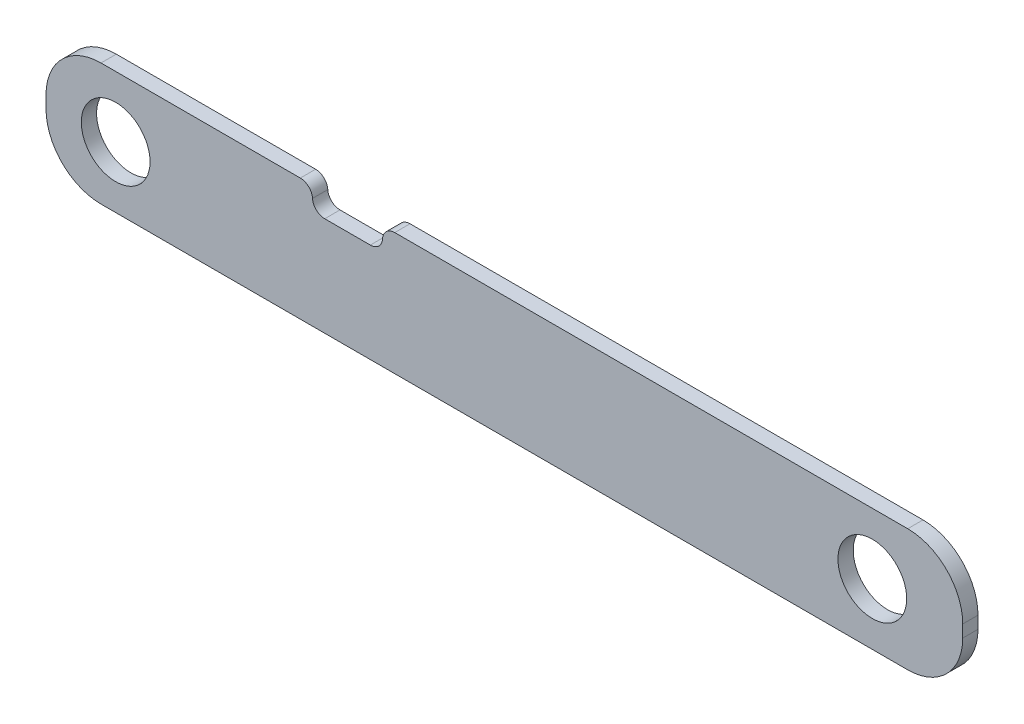
ISO-10303-21;
HEADER;
FILE_DESCRIPTION(('STEP AP214'),'2;1');
FILE_NAME('part.step','',(''),(''),'','','');
FILE_SCHEMA(('AUTOMOTIVE_DESIGN { 1 0 10303 214 1 1 1 1 }'));
ENDSEC;
DATA;
#1=APPLICATION_CONTEXT('core data for automotive mechanical design processes');
#2=APPLICATION_PROTOCOL_DEFINITION('international standard','automotive_design',2000,#1);
#3=PRODUCT_CONTEXT('',#1,'mechanical');
#4=PRODUCT('Part','Part','',(#3));
#5=PRODUCT_RELATED_PRODUCT_CATEGORY('part','',(#4));
#6=PRODUCT_DEFINITION_FORMATION('','',#4);
#7=PRODUCT_DEFINITION_CONTEXT('part definition',#1,'design');
#8=PRODUCT_DEFINITION('design','',#6,#7);
#9=PRODUCT_DEFINITION_SHAPE('','',#8);
#10=(LENGTH_UNIT() NAMED_UNIT(*) SI_UNIT(.MILLI.,.METRE.));
#11=(NAMED_UNIT(*) PLANE_ANGLE_UNIT() SI_UNIT($,.RADIAN.));
#12=(NAMED_UNIT(*) SI_UNIT($,.STERADIAN.) SOLID_ANGLE_UNIT());
#13=UNCERTAINTY_MEASURE_WITH_UNIT(LENGTH_MEASURE(1.E-05),#10,'distance_accuracy_value','');
#14=(GEOMETRIC_REPRESENTATION_CONTEXT(3) GLOBAL_UNCERTAINTY_ASSIGNED_CONTEXT((#13)) GLOBAL_UNIT_ASSIGNED_CONTEXT((#10,
#11,#12)) REPRESENTATION_CONTEXT('',''));
#15=CARTESIAN_POINT('',(0.,0.,0.));
#16=DIRECTION('',(0.,0.,1.));
#17=DIRECTION('',(1.,0.,0.));
#18=AXIS2_PLACEMENT_3D('',#15,#16,#17);
#19=CARTESIAN_POINT('',(-237.22641509434,105.433962264151,6.35));
#20=DIRECTION('',(0.,-1.,0.));
#21=DIRECTION('',(0.,0.,-1.));
#22=AXIS2_PLACEMENT_3D('',#19,#20,#21);
#23=PLANE('',#22);
#24=DIRECTION('',(-1.,0.,0.));
#25=VECTOR('',#24,1.);
#26=CARTESIAN_POINT('',(-237.22641509434,105.433962264151,0.));
#27=LINE('',#26,#25);
#28=CARTESIAN_POINT('',(120.91358490566,105.433962264151,0.));
#29=VERTEX_POINT('',#28);
#30=CARTESIAN_POINT('',(-92.2791363600619,105.433962264151,0.));
#31=VERTEX_POINT('',#30);
#32=EDGE_CURVE('E158',#29,#31,#27,.T.);
#33=ORIENTED_EDGE('',*,*,#32,.T.);
#34=DIRECTION('',(0.,0.,1.));
#35=VECTOR('',#34,1.);
#36=CARTESIAN_POINT('',(-92.2791363600619,105.433962264151,6.35));
#37=LINE('',#36,#35);
#38=CARTESIAN_POINT('',(-92.2791363600619,105.433962264151,6.35));
#39=VERTEX_POINT('',#38);
#40=EDGE_CURVE('E239',#31,#39,#37,.T.);
#41=ORIENTED_EDGE('',*,*,#40,.T.);
#42=DIRECTION('',(-1.,0.,0.));
#43=VECTOR('',#42,1.);
#44=CARTESIAN_POINT('',(-237.22641509434,105.433962264151,6.35));
#45=LINE('',#44,#43);
#46=CARTESIAN_POINT('',(120.91358490566,105.433962264151,6.35));
#47=VERTEX_POINT('',#46);
#48=EDGE_CURVE('E161',#47,#39,#45,.T.);
#49=ORIENTED_EDGE('',*,*,#48,.F.);
#50=DIRECTION('',(0.,0.,-1.));
#51=VECTOR('',#50,1.);
#52=CARTESIAN_POINT('',(120.91358490566,105.433962264151,6.35));
#53=LINE('',#52,#51);
#54=EDGE_CURVE('E146',#47,#29,#53,.T.);
#55=ORIENTED_EDGE('',*,*,#54,.T.);
#56=EDGE_LOOP('',(#33,#41,#49,#55));
#57=FACE_BOUND('',#56,.T.);
#58=ADVANCED_FACE('F39',(#57),#23,.F.);
#59=CARTESIAN_POINT('',(-237.22641509434,105.433962264151,6.35));
#60=DIRECTION('',(1.,0.,0.));
#61=DIRECTION('',(0.,1.,0.));
#62=AXIS2_PLACEMENT_3D('',#59,#60,#61);
#63=PLANE('',#62);
#64=DIRECTION('',(0.,-1.,0.));
#65=VECTOR('',#64,1.);
#66=CARTESIAN_POINT('',(-237.22641509434,105.433962264151,6.35));
#67=LINE('',#66,#65);
#68=CARTESIAN_POINT('',(-237.22641509434,82.5739622641509,6.35));
#69=VERTEX_POINT('',#68);
#70=CARTESIAN_POINT('',(-237.22641509434,77.4939622641509,6.35));
#71=VERTEX_POINT('',#70);
#72=EDGE_CURVE('E168',#69,#71,#67,.T.);
#73=ORIENTED_EDGE('',*,*,#72,.F.);
#74=DIRECTION('',(0.,0.,-1.));
#75=VECTOR('',#74,1.);
#76=CARTESIAN_POINT('',(-237.22641509434,82.5739622641509,6.35));
#77=LINE('',#76,#75);
#78=CARTESIAN_POINT('',(-237.22641509434,82.5739622641509,0.));
#79=VERTEX_POINT('',#78);
#80=EDGE_CURVE('E214',#69,#79,#77,.T.);
#81=ORIENTED_EDGE('',*,*,#80,.T.);
#82=DIRECTION('',(0.,-1.,0.));
#83=VECTOR('',#82,1.);
#84=CARTESIAN_POINT('',(-237.22641509434,105.433962264151,0.));
#85=LINE('',#84,#83);
#86=CARTESIAN_POINT('',(-237.22641509434,77.4939622641509,0.));
#87=VERTEX_POINT('',#86);
#88=EDGE_CURVE('E278',#79,#87,#85,.T.);
#89=ORIENTED_EDGE('',*,*,#88,.T.);
#90=DIRECTION('',(0.,0.,-1.));
#91=VECTOR('',#90,1.);
#92=CARTESIAN_POINT('',(-237.22641509434,77.4939622641509,6.35));
#93=LINE('',#92,#91);
#94=EDGE_CURVE('E207',#87,#71,#93,.F.);
#95=ORIENTED_EDGE('',*,*,#94,.T.);
#96=EDGE_LOOP('',(#73,#81,#89,#95));
#97=FACE_BOUND('',#96,.T.);
#98=ADVANCED_FACE('F305',(#97),#63,.F.);
#99=CARTESIAN_POINT('',(-237.22641509434,54.6339622641509,6.35));
#100=DIRECTION('',(0.,1.,0.));
#101=DIRECTION('',(-1.,0.,0.));
#102=AXIS2_PLACEMENT_3D('',#99,#100,#101);
#103=PLANE('',#102);
#104=DIRECTION('',(1.,0.,0.));
#105=VECTOR('',#104,1.);
#106=CARTESIAN_POINT('',(-237.22641509434,54.6339622641509,6.35));
#107=LINE('',#106,#105);
#108=CARTESIAN_POINT('',(-214.36641509434,54.6339622641509,6.35));
#109=VERTEX_POINT('',#108);
#110=CARTESIAN_POINT('',(120.91358490566,54.633962264151,6.35));
#111=VERTEX_POINT('',#110);
#112=EDGE_CURVE('E173',#109,#111,#107,.T.);
#113=ORIENTED_EDGE('',*,*,#112,.F.);
#114=DIRECTION('',(0.,0.,-1.));
#115=VECTOR('',#114,1.);
#116=CARTESIAN_POINT('',(-214.36641509434,54.6339622641509,6.35));
#117=LINE('',#116,#115);
#118=CARTESIAN_POINT('',(-214.36641509434,54.6339622641509,0.));
#119=VERTEX_POINT('',#118);
#120=EDGE_CURVE('E199',#109,#119,#117,.T.);
#121=ORIENTED_EDGE('',*,*,#120,.T.);
#122=DIRECTION('',(1.,0.,0.));
#123=VECTOR('',#122,1.);
#124=CARTESIAN_POINT('',(-237.22641509434,54.6339622641509,0.));
#125=LINE('',#124,#123);
#126=CARTESIAN_POINT('',(120.91358490566,54.633962264151,0.));
#127=VERTEX_POINT('',#126);
#128=EDGE_CURVE('E280',#119,#127,#125,.T.);
#129=ORIENTED_EDGE('',*,*,#128,.T.);
#130=DIRECTION('',(0.,0.,-1.));
#131=VECTOR('',#130,1.);
#132=CARTESIAN_POINT('',(120.91358490566,54.633962264151,6.35));
#133=LINE('',#132,#131);
#134=EDGE_CURVE('E192',#127,#111,#133,.F.);
#135=ORIENTED_EDGE('',*,*,#134,.T.);
#136=EDGE_LOOP('',(#113,#121,#129,#135));
#137=FACE_BOUND('',#136,.T.);
#138=ADVANCED_FACE('F294',(#137),#103,.F.);
#139=CARTESIAN_POINT('',(143.77358490566,105.433962264151,6.35));
#140=DIRECTION('',(-1.,0.,0.));
#141=DIRECTION('',(0.,-1.,0.));
#142=AXIS2_PLACEMENT_3D('',#139,#140,#141);
#143=PLANE('',#142);
#144=DIRECTION('',(0.,1.,0.));
#145=VECTOR('',#144,1.);
#146=CARTESIAN_POINT('',(143.77358490566,105.433962264151,6.35));
#147=LINE('',#146,#145);
#148=CARTESIAN_POINT('',(143.77358490566,77.493962264151,6.35));
#149=VERTEX_POINT('',#148);
#150=CARTESIAN_POINT('',(143.77358490566,82.5739622641509,6.35));
#151=VERTEX_POINT('',#150);
#152=EDGE_CURVE('E271',#149,#151,#147,.T.);
#153=ORIENTED_EDGE('',*,*,#152,.F.);
#154=DIRECTION('',(0.,0.,-1.));
#155=VECTOR('',#154,1.);
#156=CARTESIAN_POINT('',(143.77358490566,77.493962264151,6.35));
#157=LINE('',#156,#155);
#158=CARTESIAN_POINT('',(143.77358490566,77.493962264151,0.));
#159=VERTEX_POINT('',#158);
#160=EDGE_CURVE('E184',#149,#159,#157,.T.);
#161=ORIENTED_EDGE('',*,*,#160,.T.);
#162=DIRECTION('',(0.,1.,0.));
#163=VECTOR('',#162,1.);
#164=CARTESIAN_POINT('',(143.77358490566,105.433962264151,0.));
#165=LINE('',#164,#163);
#166=CARTESIAN_POINT('',(143.77358490566,82.5739622641509,0.));
#167=VERTEX_POINT('',#166);
#168=EDGE_CURVE('E175',#159,#167,#165,.T.);
#169=ORIENTED_EDGE('',*,*,#168,.T.);
#170=DIRECTION('',(0.,0.,-1.));
#171=VECTOR('',#170,1.);
#172=CARTESIAN_POINT('',(143.77358490566,82.5739622641509,6.35));
#173=LINE('',#172,#171);
#174=EDGE_CURVE('E148',#167,#151,#173,.F.);
#175=ORIENTED_EDGE('',*,*,#174,.T.);
#176=EDGE_LOOP('',(#153,#161,#169,#175));
#177=FACE_BOUND('',#176,.T.);
#178=ADVANCED_FACE('F288',(#177),#143,.F.);
#179=CARTESIAN_POINT('',(-131.523813882823,105.433962264151,6.35));
#180=VERTEX_POINT('',#179);
#181=CARTESIAN_POINT('',(-214.36641509434,105.433962264151,6.35));
#182=VERTEX_POINT('',#181);
#183=EDGE_CURVE('E268',#180,#182,#45,.T.);
#184=ORIENTED_EDGE('',*,*,#183,.F.);
#185=DIRECTION('',(0.,0.,1.));
#186=VECTOR('',#185,1.);
#187=CARTESIAN_POINT('',(-131.523813882823,105.433962264151,6.35));
#188=LINE('',#187,#186);
#189=CARTESIAN_POINT('',(-131.523813882823,105.433962264151,0.));
#190=VERTEX_POINT('',#189);
#191=EDGE_CURVE('E232',#180,#190,#188,.F.);
#192=ORIENTED_EDGE('',*,*,#191,.T.);
#193=CARTESIAN_POINT('',(-214.36641509434,105.433962264151,0.));
#194=VERTEX_POINT('',#193);
#195=EDGE_CURVE('E169',#190,#194,#27,.T.);
#196=ORIENTED_EDGE('',*,*,#195,.T.);
#197=DIRECTION('',(0.,0.,-1.));
#198=VECTOR('',#197,1.);
#199=CARTESIAN_POINT('',(-214.36641509434,105.433962264151,6.35));
#200=LINE('',#199,#198);
#201=EDGE_CURVE('E222',#194,#182,#200,.F.);
#202=ORIENTED_EDGE('',*,*,#201,.T.);
#203=EDGE_LOOP('',(#184,#192,#196,#202));
#204=FACE_BOUND('',#203,.T.);
#205=ADVANCED_FACE('F312',(#204),#23,.F.);
#206=CARTESIAN_POINT('',(0.,0.,6.35));
#207=DIRECTION('',(0.,0.,1.));
#208=DIRECTION('',(1.,0.,0.));
#209=AXIS2_PLACEMENT_3D('',#206,#207,#208);
#210=PLANE('',#209);
#211=CARTESIAN_POINT('',(106.195061697882,80.033962264151,6.35));
#212=DIRECTION('',(0.,0.,1.));
#213=DIRECTION('',(1.,0.,0.));
#214=AXIS2_PLACEMENT_3D('',#211,#212,#213);
#215=CIRCLE('',#214,14.2875);
#216=CARTESIAN_POINT('',(120.482561697882,80.033962264151,6.35));
#217=VERTEX_POINT('',#216);
#218=EDGE_CURVE('E327',#217,#217,#215,.T.);
#219=ORIENTED_EDGE('',*,*,#218,.F.);
#220=EDGE_LOOP('',(#219));
#221=FACE_BOUND('',#220,.T.);
#222=ORIENTED_EDGE('',*,*,#48,.T.);
#223=CARTESIAN_POINT('',(-92.2791363600619,100.353962264151,6.35));
#224=DIRECTION('',(0.,0.,1.));
#225=DIRECTION('',(1.,0.,0.));
#226=AXIS2_PLACEMENT_3D('',#223,#224,#225);
#227=CIRCLE('',#226,5.07999999999999);
#228=CARTESIAN_POINT('',(-97.3507309280969,100.646072752627,6.35));
#229=VERTEX_POINT('',#228);
#230=EDGE_CURVE('E242',#39,#229,#227,.T.);
#231=ORIENTED_EDGE('',*,*,#230,.T.);
#232=CARTESIAN_POINT('',(-102.422325496132,100.938183241103,6.35));
#233=DIRECTION('',(0.,0.,1.));
#234=DIRECTION('',(1.,0.,0.));
#235=AXIS2_PLACEMENT_3D('',#232,#233,#234);
#236=CIRCLE('',#235,5.07999999999999);
#237=CARTESIAN_POINT('',(-102.422325496132,95.8581832411029,6.35));
#238=VERTEX_POINT('',#237);
#239=EDGE_CURVE('E48',#229,#238,#236,.F.);
#240=ORIENTED_EDGE('',*,*,#239,.T.);
#241=DIRECTION('',(1.,0.,0.));
#242=VECTOR('',#241,1.);
#243=CARTESIAN_POINT('',(-126.443813882823,95.8581832411029,6.35));
#244=LINE('',#243,#242);
#245=CARTESIAN_POINT('',(-121.380624746753,95.8581832411029,6.35));
#246=VERTEX_POINT('',#245);
#247=EDGE_CURVE('E328',#246,#238,#244,.T.);
#248=ORIENTED_EDGE('',*,*,#247,.F.);
#249=CARTESIAN_POINT('',(-121.380624746753,100.938183241103,6.35));
#250=DIRECTION('',(0.,0.,1.));
#251=DIRECTION('',(1.,0.,0.));
#252=AXIS2_PLACEMENT_3D('',#249,#250,#251);
#253=CIRCLE('',#252,5.07999999999999);
#254=CARTESIAN_POINT('',(-126.452219314788,100.646072752627,6.35));
#255=VERTEX_POINT('',#254);
#256=EDGE_CURVE('E254',#246,#255,#253,.F.);
#257=ORIENTED_EDGE('',*,*,#256,.T.);
#258=CARTESIAN_POINT('',(-131.523813882823,100.353962264151,6.35));
#259=DIRECTION('',(0.,0.,1.));
#260=DIRECTION('',(1.,0.,0.));
#261=AXIS2_PLACEMENT_3D('',#258,#259,#260);
#262=CIRCLE('',#261,5.07999999999999);
#263=EDGE_CURVE('E229',#255,#180,#262,.T.);
#264=ORIENTED_EDGE('',*,*,#263,.T.);
#265=ORIENTED_EDGE('',*,*,#183,.T.);
#266=CARTESIAN_POINT('',(-214.36641509434,82.5739622641509,6.35));
#267=DIRECTION('',(0.,0.,1.));
#268=DIRECTION('',(1.,0.,0.));
#269=AXIS2_PLACEMENT_3D('',#266,#267,#268);
#270=CIRCLE('',#269,22.86);
#271=EDGE_CURVE('E226',#182,#69,#270,.T.);
#272=ORIENTED_EDGE('',*,*,#271,.T.);
#273=ORIENTED_EDGE('',*,*,#72,.T.);
#274=CARTESIAN_POINT('',(-214.36641509434,77.493962264151,6.35));
#275=DIRECTION('',(0.,0.,1.));
#276=DIRECTION('',(1.,0.,0.));
#277=AXIS2_PLACEMENT_3D('',#274,#275,#276);
#278=CIRCLE('',#277,22.86);
#279=EDGE_CURVE('E211',#71,#109,#278,.T.);
#280=ORIENTED_EDGE('',*,*,#279,.T.);
#281=ORIENTED_EDGE('',*,*,#112,.T.);
#282=CARTESIAN_POINT('',(120.91358490566,77.493962264151,6.35));
#283=DIRECTION('',(0.,0.,1.));
#284=DIRECTION('',(1.,0.,0.));
#285=AXIS2_PLACEMENT_3D('',#282,#283,#284);
#286=CIRCLE('',#285,22.86);
#287=EDGE_CURVE('E196',#111,#149,#286,.T.);
#288=ORIENTED_EDGE('',*,*,#287,.T.);
#289=ORIENTED_EDGE('',*,*,#152,.T.);
#290=CARTESIAN_POINT('',(120.91358490566,82.5739622641509,6.35));
#291=DIRECTION('',(0.,0.,1.));
#292=DIRECTION('',(1.,0.,0.));
#293=AXIS2_PLACEMENT_3D('',#290,#291,#292);
#294=CIRCLE('',#293,22.86);
#295=EDGE_CURVE('E181',#151,#47,#294,.T.);
#296=ORIENTED_EDGE('',*,*,#295,.T.);
#297=EDGE_LOOP('',(#222,#231,#240,#248,#257,#264,#265,#272,#273,#280,#281,#288,#289,#296));
#298=FACE_BOUND('',#297,.T.);
#299=CARTESIAN_POINT('',(-208.270713759816,80.033962264151,6.35));
#300=DIRECTION('',(0.,0.,1.));
#301=DIRECTION('',(1.,0.,0.));
#302=AXIS2_PLACEMENT_3D('',#299,#300,#301);
#303=CIRCLE('',#302,14.2875);
#304=CARTESIAN_POINT('',(-193.983213759816,80.033962264151,6.35));
#305=VERTEX_POINT('',#304);
#306=EDGE_CURVE('E340',#305,#305,#303,.T.);
#307=ORIENTED_EDGE('',*,*,#306,.F.);
#308=EDGE_LOOP('',(#307));
#309=FACE_BOUND('',#308,.T.);
#310=ADVANCED_FACE('F347',(#221,#298,#309),#210,.T.);
#311=CARTESIAN_POINT('',(0.,0.,0.));
#312=DIRECTION('',(0.,0.,1.));
#313=DIRECTION('',(1.,0.,0.));
#314=AXIS2_PLACEMENT_3D('',#311,#312,#313);
#315=PLANE('',#314);
#316=CARTESIAN_POINT('',(106.195061697882,80.033962264151,0.));
#317=DIRECTION('',(0.,0.,1.));
#318=DIRECTION('',(1.,0.,0.));
#319=AXIS2_PLACEMENT_3D('',#316,#317,#318);
#320=CIRCLE('',#319,14.2875);
#321=CARTESIAN_POINT('',(120.482561697882,80.033962264151,0.));
#322=VERTEX_POINT('',#321);
#323=EDGE_CURVE('E281',#322,#322,#320,.T.);
#324=ORIENTED_EDGE('',*,*,#323,.T.);
#325=EDGE_LOOP('',(#324));
#326=FACE_BOUND('',#325,.T.);
#327=CARTESIAN_POINT('',(-208.270713759816,80.033962264151,0.));
#328=DIRECTION('',(0.,0.,1.));
#329=DIRECTION('',(1.,0.,0.));
#330=AXIS2_PLACEMENT_3D('',#327,#328,#329);
#331=CIRCLE('',#330,14.2875);
#332=CARTESIAN_POINT('',(-193.983213759816,80.033962264151,0.));
#333=VERTEX_POINT('',#332);
#334=EDGE_CURVE('E334',#333,#333,#331,.T.);
#335=ORIENTED_EDGE('',*,*,#334,.T.);
#336=EDGE_LOOP('',(#335));
#337=FACE_BOUND('',#336,.T.);
#338=DIRECTION('',(1.,0.,0.));
#339=VECTOR('',#338,1.);
#340=CARTESIAN_POINT('',(-126.443813882823,95.8581832411029,0.));
#341=LINE('',#340,#339);
#342=CARTESIAN_POINT('',(-121.380624746753,95.8581832411029,0.));
#343=VERTEX_POINT('',#342);
#344=CARTESIAN_POINT('',(-102.422325496132,95.8581832411029,0.));
#345=VERTEX_POINT('',#344);
#346=EDGE_CURVE('E323',#343,#345,#341,.T.);
#347=ORIENTED_EDGE('',*,*,#346,.T.);
#348=CARTESIAN_POINT('',(-102.422325496132,100.938183241103,0.));
#349=DIRECTION('',(0.,0.,1.));
#350=DIRECTION('',(1.,0.,0.));
#351=AXIS2_PLACEMENT_3D('',#348,#349,#350);
#352=CIRCLE('',#351,5.07999999999999);
#353=CARTESIAN_POINT('',(-97.3507309280969,100.646072752627,0.));
#354=VERTEX_POINT('',#353);
#355=EDGE_CURVE('E11',#345,#354,#352,.T.);
#356=ORIENTED_EDGE('',*,*,#355,.T.);
#357=CARTESIAN_POINT('',(-92.2791363600619,100.353962264151,0.));
#358=DIRECTION('',(0.,0.,1.));
#359=DIRECTION('',(1.,0.,0.));
#360=AXIS2_PLACEMENT_3D('',#357,#358,#359);
#361=CIRCLE('',#360,5.07999999999999);
#362=EDGE_CURVE('E166',#354,#31,#361,.F.);
#363=ORIENTED_EDGE('',*,*,#362,.T.);
#364=ORIENTED_EDGE('',*,*,#32,.F.);
#365=CARTESIAN_POINT('',(120.91358490566,82.5739622641509,0.));
#366=DIRECTION('',(0.,0.,1.));
#367=DIRECTION('',(1.,0.,0.));
#368=AXIS2_PLACEMENT_3D('',#365,#366,#367);
#369=CIRCLE('',#368,22.86);
#370=EDGE_CURVE('E142',#29,#167,#369,.F.);
#371=ORIENTED_EDGE('',*,*,#370,.T.);
#372=ORIENTED_EDGE('',*,*,#168,.F.);
#373=CARTESIAN_POINT('',(120.91358490566,77.493962264151,0.));
#374=DIRECTION('',(0.,0.,1.));
#375=DIRECTION('',(1.,0.,0.));
#376=AXIS2_PLACEMENT_3D('',#373,#374,#375);
#377=CIRCLE('',#376,22.86);
#378=EDGE_CURVE('E188',#159,#127,#377,.F.);
#379=ORIENTED_EDGE('',*,*,#378,.T.);
#380=ORIENTED_EDGE('',*,*,#128,.F.);
#381=CARTESIAN_POINT('',(-214.36641509434,77.493962264151,0.));
#382=DIRECTION('',(0.,0.,1.));
#383=DIRECTION('',(1.,0.,0.));
#384=AXIS2_PLACEMENT_3D('',#381,#382,#383);
#385=CIRCLE('',#384,22.86);
#386=EDGE_CURVE('E203',#119,#87,#385,.F.);
#387=ORIENTED_EDGE('',*,*,#386,.T.);
#388=ORIENTED_EDGE('',*,*,#88,.F.);
#389=CARTESIAN_POINT('',(-214.36641509434,82.5739622641509,0.));
#390=DIRECTION('',(0.,0.,1.));
#391=DIRECTION('',(1.,0.,0.));
#392=AXIS2_PLACEMENT_3D('',#389,#390,#391);
#393=CIRCLE('',#392,22.86);
#394=EDGE_CURVE('E218',#79,#194,#393,.F.);
#395=ORIENTED_EDGE('',*,*,#394,.T.);
#396=ORIENTED_EDGE('',*,*,#195,.F.);
#397=CARTESIAN_POINT('',(-131.523813882823,100.353962264151,0.));
#398=DIRECTION('',(0.,0.,1.));
#399=DIRECTION('',(1.,0.,0.));
#400=AXIS2_PLACEMENT_3D('',#397,#398,#399);
#401=CIRCLE('',#400,5.07999999999999);
#402=CARTESIAN_POINT('',(-126.452219314788,100.646072752627,0.));
#403=VERTEX_POINT('',#402);
#404=EDGE_CURVE('E235',#190,#403,#401,.F.);
#405=ORIENTED_EDGE('',*,*,#404,.T.);
#406=CARTESIAN_POINT('',(-121.380624746753,100.938183241103,0.));
#407=DIRECTION('',(0.,0.,1.));
#408=DIRECTION('',(1.,0.,0.));
#409=AXIS2_PLACEMENT_3D('',#406,#407,#408);
#410=CIRCLE('',#409,5.07999999999999);
#411=EDGE_CURVE('E257',#403,#343,#410,.T.);
#412=ORIENTED_EDGE('',*,*,#411,.T.);
#413=EDGE_LOOP('',(#347,#356,#363,#364,#371,#372,#379,#380,#387,#388,#395,#396,#405,#412));
#414=FACE_BOUND('',#413,.T.);
#415=ADVANCED_FACE('F164',(#326,#337,#414),#315,.F.);
#416=CARTESIAN_POINT('',(-208.270713759816,80.033962264151,0.));
#417=DIRECTION('',(0.,0.,1.));
#418=DIRECTION('',(1.,0.,0.));
#419=AXIS2_PLACEMENT_3D('',#416,#417,#418);
#420=CYLINDRICAL_SURFACE('',#419,14.2875);
#421=ORIENTED_EDGE('',*,*,#334,.F.);
#422=EDGE_LOOP('',(#421));
#423=FACE_BOUND('',#422,.T.);
#424=ORIENTED_EDGE('',*,*,#306,.T.);
#425=EDGE_LOOP('',(#424));
#426=FACE_BOUND('',#425,.T.);
#427=ADVANCED_FACE('F345',(#423,#426),#420,.F.);
#428=CARTESIAN_POINT('',(-126.443813882823,95.8581832411029,0.));
#429=DIRECTION('',(0.,-1.,0.));
#430=DIRECTION('',(0.,0.,-1.));
#431=AXIS2_PLACEMENT_3D('',#428,#429,#430);
#432=PLANE('',#431);
#433=ORIENTED_EDGE('',*,*,#247,.T.);
#434=DIRECTION('',(0.,0.,1.));
#435=VECTOR('',#434,1.);
#436=CARTESIAN_POINT('',(-102.422325496132,95.8581832411029,0.));
#437=LINE('',#436,#435);
#438=EDGE_CURVE('E61',#238,#345,#437,.F.);
#439=ORIENTED_EDGE('',*,*,#438,.T.);
#440=ORIENTED_EDGE('',*,*,#346,.F.);
#441=DIRECTION('',(0.,0.,1.));
#442=VECTOR('',#441,1.);
#443=CARTESIAN_POINT('',(-121.380624746753,95.8581832411029,0.));
#444=LINE('',#443,#442);
#445=EDGE_CURVE('E247',#343,#246,#444,.T.);
#446=ORIENTED_EDGE('',*,*,#445,.T.);
#447=EDGE_LOOP('',(#433,#439,#440,#446));
#448=FACE_BOUND('',#447,.T.);
#449=ADVANCED_FACE('F325',(#448),#432,.F.);
#450=CARTESIAN_POINT('',(106.195061697882,80.033962264151,0.));
#451=DIRECTION('',(0.,0.,1.));
#452=DIRECTION('',(1.,0.,0.));
#453=AXIS2_PLACEMENT_3D('',#450,#451,#452);
#454=CYLINDRICAL_SURFACE('',#453,14.2875);
#455=ORIENTED_EDGE('',*,*,#323,.F.);
#456=EDGE_LOOP('',(#455));
#457=FACE_BOUND('',#456,.T.);
#458=ORIENTED_EDGE('',*,*,#218,.T.);
#459=EDGE_LOOP('',(#458));
#460=FACE_BOUND('',#459,.T.);
#461=ADVANCED_FACE('F372',(#457,#460),#454,.F.);
#462=CARTESIAN_POINT('',(120.91358490566,82.5739622641509,6.35));
#463=DIRECTION('',(0.,0.,-1.));
#464=DIRECTION('',(-1.,0.,0.));
#465=AXIS2_PLACEMENT_3D('',#462,#463,#464);
#466=CYLINDRICAL_SURFACE('',#465,22.86);
#467=ORIENTED_EDGE('',*,*,#295,.F.);
#468=ORIENTED_EDGE('',*,*,#174,.F.);
#469=ORIENTED_EDGE('',*,*,#370,.F.);
#470=ORIENTED_EDGE('',*,*,#54,.F.);
#471=EDGE_LOOP('',(#467,#468,#469,#470));
#472=FACE_BOUND('',#471,.T.);
#473=ADVANCED_FACE('F145',(#472),#466,.T.);
#474=CARTESIAN_POINT('',(120.91358490566,77.493962264151,6.35));
#475=DIRECTION('',(0.,0.,-1.));
#476=DIRECTION('',(-1.,0.,0.));
#477=AXIS2_PLACEMENT_3D('',#474,#475,#476);
#478=CYLINDRICAL_SURFACE('',#477,22.86);
#479=ORIENTED_EDGE('',*,*,#287,.F.);
#480=ORIENTED_EDGE('',*,*,#134,.F.);
#481=ORIENTED_EDGE('',*,*,#378,.F.);
#482=ORIENTED_EDGE('',*,*,#160,.F.);
#483=EDGE_LOOP('',(#479,#480,#481,#482));
#484=FACE_BOUND('',#483,.T.);
#485=ADVANCED_FACE('F293',(#484),#478,.T.);
#486=CARTESIAN_POINT('',(-214.36641509434,77.493962264151,6.35));
#487=DIRECTION('',(0.,0.,-1.));
#488=DIRECTION('',(-1.,0.,0.));
#489=AXIS2_PLACEMENT_3D('',#486,#487,#488);
#490=CYLINDRICAL_SURFACE('',#489,22.86);
#491=ORIENTED_EDGE('',*,*,#279,.F.);
#492=ORIENTED_EDGE('',*,*,#94,.F.);
#493=ORIENTED_EDGE('',*,*,#386,.F.);
#494=ORIENTED_EDGE('',*,*,#120,.F.);
#495=EDGE_LOOP('',(#491,#492,#493,#494));
#496=FACE_BOUND('',#495,.T.);
#497=ADVANCED_FACE('F298',(#496),#490,.T.);
#498=CARTESIAN_POINT('',(-214.36641509434,82.5739622641509,6.35));
#499=DIRECTION('',(0.,0.,-1.));
#500=DIRECTION('',(-1.,0.,0.));
#501=AXIS2_PLACEMENT_3D('',#498,#499,#500);
#502=CYLINDRICAL_SURFACE('',#501,22.86);
#503=ORIENTED_EDGE('',*,*,#271,.F.);
#504=ORIENTED_EDGE('',*,*,#201,.F.);
#505=ORIENTED_EDGE('',*,*,#394,.F.);
#506=ORIENTED_EDGE('',*,*,#80,.F.);
#507=EDGE_LOOP('',(#503,#504,#505,#506));
#508=FACE_BOUND('',#507,.T.);
#509=ADVANCED_FACE('F309',(#508),#502,.T.);
#510=CARTESIAN_POINT('',(-131.523813882823,100.353962264151,0.));
#511=DIRECTION('',(0.,0.,1.));
#512=DIRECTION('',(1.,0.,0.));
#513=AXIS2_PLACEMENT_3D('',#510,#511,#512);
#514=CYLINDRICAL_SURFACE('',#513,5.07999999999999);
#515=ORIENTED_EDGE('',*,*,#263,.F.);
#516=DIRECTION('',(0.,0.,1.));
#517=VECTOR('',#516,1.);
#518=CARTESIAN_POINT('',(-126.452219314788,100.646072752627,0.));
#519=LINE('',#518,#517);
#520=EDGE_CURVE('E251',#255,#403,#519,.F.);
#521=ORIENTED_EDGE('',*,*,#520,.T.);
#522=ORIENTED_EDGE('',*,*,#404,.F.);
#523=ORIENTED_EDGE('',*,*,#191,.F.);
#524=EDGE_LOOP('',(#515,#521,#522,#523));
#525=FACE_BOUND('',#524,.T.);
#526=ADVANCED_FACE('F318',(#525),#514,.T.);
#527=CARTESIAN_POINT('',(-92.2791363600619,100.353962264151,6.35));
#528=DIRECTION('',(0.,0.,1.));
#529=DIRECTION('',(1.,0.,0.));
#530=AXIS2_PLACEMENT_3D('',#527,#528,#529);
#531=CYLINDRICAL_SURFACE('',#530,5.07999999999999);
#532=ORIENTED_EDGE('',*,*,#362,.F.);
#533=DIRECTION('',(0.,0.,1.));
#534=VECTOR('',#533,1.);
#535=CARTESIAN_POINT('',(-97.3507309280969,100.646072752627,6.35));
#536=LINE('',#535,#534);
#537=EDGE_CURVE('E260',#354,#229,#536,.T.);
#538=ORIENTED_EDGE('',*,*,#537,.T.);
#539=ORIENTED_EDGE('',*,*,#230,.F.);
#540=ORIENTED_EDGE('',*,*,#40,.F.);
#541=EDGE_LOOP('',(#532,#538,#539,#540));
#542=FACE_BOUND('',#541,.T.);
#543=ADVANCED_FACE('F381',(#542),#531,.T.);
#544=CARTESIAN_POINT('',(-121.380624746753,100.938183241103,0.));
#545=DIRECTION('',(0.,0.,1.));
#546=DIRECTION('',(1.,0.,0.));
#547=AXIS2_PLACEMENT_3D('',#544,#545,#546);
#548=CYLINDRICAL_SURFACE('',#547,5.07999999999999);
#549=ORIENTED_EDGE('',*,*,#411,.F.);
#550=ORIENTED_EDGE('',*,*,#520,.F.);
#551=ORIENTED_EDGE('',*,*,#256,.F.);
#552=ORIENTED_EDGE('',*,*,#445,.F.);
#553=EDGE_LOOP('',(#549,#550,#551,#552));
#554=FACE_BOUND('',#553,.T.);
#555=ADVANCED_FACE('F321',(#554),#548,.F.);
#556=CARTESIAN_POINT('',(-102.422325496132,100.938183241103,6.35));
#557=DIRECTION('',(0.,0.,1.));
#558=DIRECTION('',(1.,0.,0.));
#559=AXIS2_PLACEMENT_3D('',#556,#557,#558);
#560=CYLINDRICAL_SURFACE('',#559,5.07999999999999);
#561=ORIENTED_EDGE('',*,*,#355,.F.);
#562=ORIENTED_EDGE('',*,*,#438,.F.);
#563=ORIENTED_EDGE('',*,*,#239,.F.);
#564=ORIENTED_EDGE('',*,*,#537,.F.);
#565=EDGE_LOOP('',(#561,#562,#563,#564));
#566=FACE_BOUND('',#565,.T.);
#567=ADVANCED_FACE('F41',(#566),#560,.F.);
#568=CLOSED_SHELL('',(#58,#98,#138,#178,#205,#310,#415,#427,#449,#461,#473,#485,#497,#509,#526,
#543,#555,#567));
#569=MANIFOLD_SOLID_BREP('B2',#568);
#570=ADVANCED_BREP_SHAPE_REPRESENTATION('',(#18,#569),#14);
#571=SHAPE_DEFINITION_REPRESENTATION(#9,#570);
ENDSEC;
END-ISO-10303-21;
